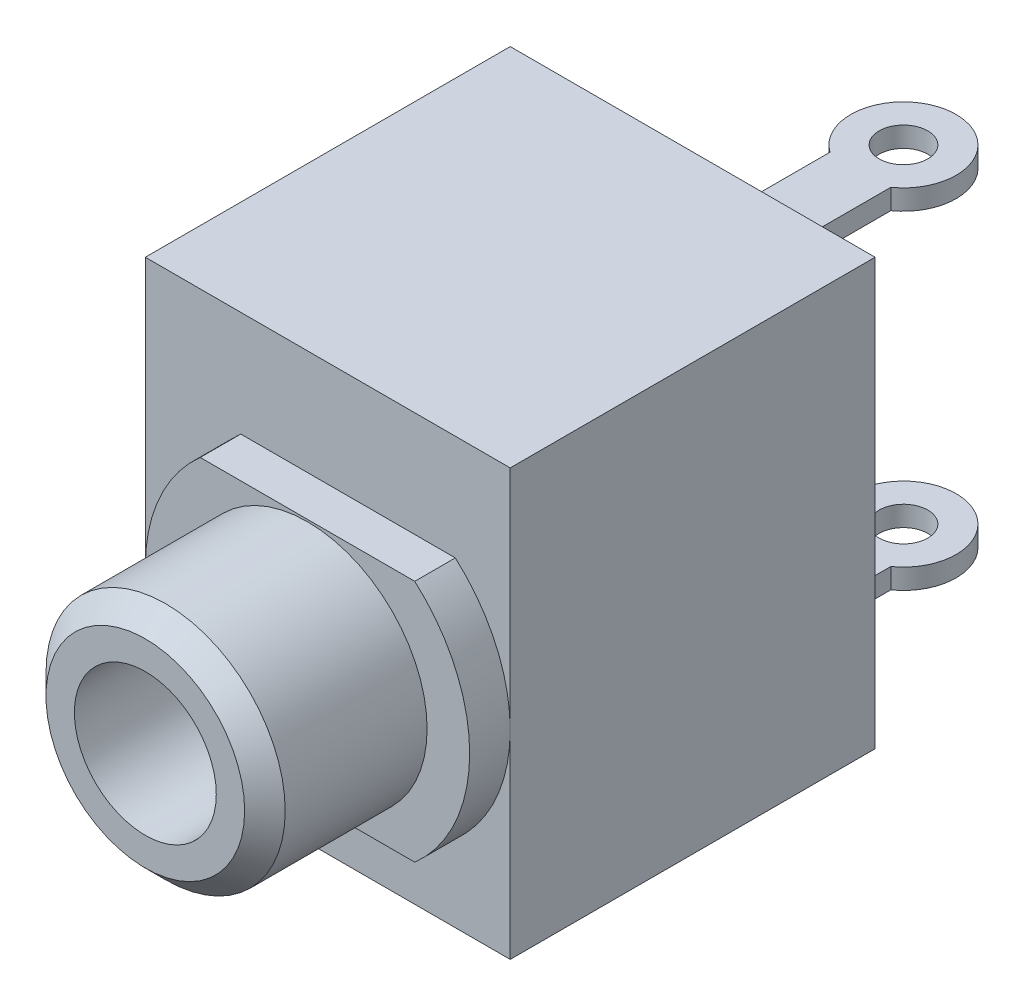
ISO-10303-21;
HEADER;
FILE_DESCRIPTION(('STEP AP214'),'2;1');
FILE_NAME('part.step','',(''),(''),'','','');
FILE_SCHEMA(('AUTOMOTIVE_DESIGN { 1 0 10303 214 1 1 1 1 }'));
ENDSEC;
DATA;
#1=APPLICATION_CONTEXT('core data for automotive mechanical design processes');
#2=APPLICATION_PROTOCOL_DEFINITION('international standard','automotive_design',2000,#1);
#3=PRODUCT_CONTEXT('',#1,'mechanical');
#4=PRODUCT('Part','Part','',(#3));
#5=PRODUCT_RELATED_PRODUCT_CATEGORY('part','',(#4));
#6=PRODUCT_DEFINITION_FORMATION('','',#4);
#7=PRODUCT_DEFINITION_CONTEXT('part definition',#1,'design');
#8=PRODUCT_DEFINITION('design','',#6,#7);
#9=PRODUCT_DEFINITION_SHAPE('','',#8);
#10=(LENGTH_UNIT() NAMED_UNIT(*) SI_UNIT(.MILLI.,.METRE.));
#11=(NAMED_UNIT(*) PLANE_ANGLE_UNIT() SI_UNIT($,.RADIAN.));
#12=(NAMED_UNIT(*) SI_UNIT($,.STERADIAN.) SOLID_ANGLE_UNIT());
#13=UNCERTAINTY_MEASURE_WITH_UNIT(LENGTH_MEASURE(1.E-05),#10,'distance_accuracy_value','');
#14=(GEOMETRIC_REPRESENTATION_CONTEXT(3) GLOBAL_UNCERTAINTY_ASSIGNED_CONTEXT((#13)) GLOBAL_UNIT_ASSIGNED_CONTEXT((#10,
#11,#12)) REPRESENTATION_CONTEXT('',''));
#15=CARTESIAN_POINT('',(0.,0.,0.));
#16=DIRECTION('',(0.,0.,1.));
#17=DIRECTION('',(1.,0.,0.));
#18=AXIS2_PLACEMENT_3D('',#15,#16,#17);
#19=CARTESIAN_POINT('',(0.,0.,0.));
#20=DIRECTION('',(0.,0.,1.));
#21=DIRECTION('',(1.,0.,0.));
#22=AXIS2_PLACEMENT_3D('',#19,#20,#21);
#23=PLANE('',#22);
#24=DIRECTION('',(0.,-1.,0.));
#25=VECTOR('',#24,1.);
#26=CARTESIAN_POINT('',(-3.55,0.,0.));
#27=LINE('',#26,#25);
#28=CARTESIAN_POINT('',(-3.55,-0.650000000000002,0.));
#29=VERTEX_POINT('',#28);
#30=CARTESIAN_POINT('',(-3.55,-2.15,0.));
#31=VERTEX_POINT('',#30);
#32=EDGE_CURVE('E525',#29,#31,#27,.T.);
#33=ORIENTED_EDGE('',*,*,#32,.F.);
#34=DIRECTION('',(1.,0.,0.));
#35=VECTOR('',#34,1.);
#36=CARTESIAN_POINT('',(0.,-0.650000000000002,0.));
#37=LINE('',#36,#35);
#38=CARTESIAN_POINT('',(-4.05,-0.650000000000002,0.));
#39=VERTEX_POINT('',#38);
#40=EDGE_CURVE('E533',#39,#29,#37,.T.);
#41=ORIENTED_EDGE('',*,*,#40,.F.);
#42=DIRECTION('',(0.,-1.,0.));
#43=VECTOR('',#42,1.);
#44=CARTESIAN_POINT('',(-4.05,0.,0.));
#45=LINE('',#44,#43);
#46=CARTESIAN_POINT('',(-4.05,-2.15,0.));
#47=VERTEX_POINT('',#46);
#48=EDGE_CURVE('E194',#39,#47,#45,.T.);
#49=ORIENTED_EDGE('',*,*,#48,.T.);
#50=DIRECTION('',(1.,0.,0.));
#51=VECTOR('',#50,1.);
#52=CARTESIAN_POINT('',(0.,-2.15,0.));
#53=LINE('',#52,#51);
#54=EDGE_CURVE('E198',#47,#31,#53,.T.);
#55=ORIENTED_EDGE('',*,*,#54,.T.);
#56=EDGE_LOOP('',(#33,#41,#49,#55));
#57=FACE_BOUND('',#56,.T.);
#58=DIRECTION('',(0.,-1.,0.));
#59=VECTOR('',#58,1.);
#60=CARTESIAN_POINT('',(4.,0.,0.));
#61=LINE('',#60,#59);
#62=CARTESIAN_POINT('',(4.,5.6,0.));
#63=VERTEX_POINT('',#62);
#64=CARTESIAN_POINT('',(4.,-4.9,0.));
#65=VERTEX_POINT('',#64);
#66=EDGE_CURVE('E260',#63,#65,#61,.T.);
#67=ORIENTED_EDGE('',*,*,#66,.T.);
#68=DIRECTION('',(1.,0.,0.));
#69=VECTOR('',#68,1.);
#70=CARTESIAN_POINT('',(0.,-4.9,0.));
#71=LINE('',#70,#69);
#72=CARTESIAN_POINT('',(-5.,-4.9,0.));
#73=VERTEX_POINT('',#72);
#74=EDGE_CURVE('E281',#73,#65,#71,.T.);
#75=ORIENTED_EDGE('',*,*,#74,.F.);
#76=DIRECTION('',(0.,-1.,0.));
#77=VECTOR('',#76,1.);
#78=CARTESIAN_POINT('',(-5.,0.,0.));
#79=LINE('',#78,#77);
#80=CARTESIAN_POINT('',(-5.,5.6,0.));
#81=VERTEX_POINT('',#80);
#82=EDGE_CURVE('E279',#81,#73,#79,.T.);
#83=ORIENTED_EDGE('',*,*,#82,.F.);
#84=DIRECTION('',(1.,0.,0.));
#85=VECTOR('',#84,1.);
#86=CARTESIAN_POINT('',(0.,5.6,0.));
#87=LINE('',#86,#85);
#88=EDGE_CURVE('E276',#81,#63,#87,.T.);
#89=ORIENTED_EDGE('',*,*,#88,.T.);
#90=EDGE_LOOP('',(#67,#75,#83,#89));
#91=FACE_BOUND('',#90,.T.);
#92=DIRECTION('',(0.,-1.,0.));
#93=VECTOR('',#92,1.);
#94=CARTESIAN_POINT('',(1.75,0.,0.));
#95=LINE('',#94,#93);
#96=CARTESIAN_POINT('',(1.75,-3.45,0.));
#97=VERTEX_POINT('',#96);
#98=CARTESIAN_POINT('',(1.75,-3.95,0.));
#99=VERTEX_POINT('',#98);
#100=EDGE_CURVE('E202',#97,#99,#95,.T.);
#101=ORIENTED_EDGE('',*,*,#100,.F.);
#102=DIRECTION('',(1.,0.,0.));
#103=VECTOR('',#102,1.);
#104=CARTESIAN_POINT('',(0.,-3.45,0.));
#105=LINE('',#104,#103);
#106=CARTESIAN_POINT('',(0.25,-3.45,0.));
#107=VERTEX_POINT('',#106);
#108=EDGE_CURVE('E205',#107,#97,#105,.T.);
#109=ORIENTED_EDGE('',*,*,#108,.F.);
#110=DIRECTION('',(0.,-1.,0.));
#111=VECTOR('',#110,1.);
#112=CARTESIAN_POINT('',(0.25,0.,0.));
#113=LINE('',#112,#111);
#114=CARTESIAN_POINT('',(0.25,-3.95,0.));
#115=VERTEX_POINT('',#114);
#116=EDGE_CURVE('E208',#107,#115,#113,.T.);
#117=ORIENTED_EDGE('',*,*,#116,.T.);
#118=DIRECTION('',(1.,0.,0.));
#119=VECTOR('',#118,1.);
#120=CARTESIAN_POINT('',(0.,-3.95,0.));
#121=LINE('',#120,#119);
#122=EDGE_CURVE('E211',#115,#99,#121,.T.);
#123=ORIENTED_EDGE('',*,*,#122,.T.);
#124=EDGE_LOOP('',(#101,#109,#117,#123));
#125=FACE_BOUND('',#124,.T.);
#126=DIRECTION('',(0.,-1.,0.));
#127=VECTOR('',#126,1.);
#128=CARTESIAN_POINT('',(1.75,0.,0.));
#129=LINE('',#128,#127);
#130=CARTESIAN_POINT('',(1.75,4.65,0.));
#131=VERTEX_POINT('',#130);
#132=CARTESIAN_POINT('',(1.75,4.15,0.));
#133=VERTEX_POINT('',#132);
#134=EDGE_CURVE('E510',#131,#133,#129,.T.);
#135=ORIENTED_EDGE('',*,*,#134,.F.);
#136=DIRECTION('',(1.,0.,0.));
#137=VECTOR('',#136,1.);
#138=CARTESIAN_POINT('',(0.,4.65,0.));
#139=LINE('',#138,#137);
#140=CARTESIAN_POINT('',(0.25,4.65,0.));
#141=VERTEX_POINT('',#140);
#142=EDGE_CURVE('E513',#141,#131,#139,.T.);
#143=ORIENTED_EDGE('',*,*,#142,.F.);
#144=DIRECTION('',(0.,-1.,0.));
#145=VECTOR('',#144,1.);
#146=CARTESIAN_POINT('',(0.250000000000001,0.,0.));
#147=LINE('',#146,#145);
#148=CARTESIAN_POINT('',(0.25,4.15,0.));
#149=VERTEX_POINT('',#148);
#150=EDGE_CURVE('E516',#141,#149,#147,.T.);
#151=ORIENTED_EDGE('',*,*,#150,.T.);
#152=DIRECTION('',(1.,0.,0.));
#153=VECTOR('',#152,1.);
#154=CARTESIAN_POINT('',(0.,4.15,0.));
#155=LINE('',#154,#153);
#156=EDGE_CURVE('E519',#149,#133,#155,.T.);
#157=ORIENTED_EDGE('',*,*,#156,.T.);
#158=EDGE_LOOP('',(#135,#143,#151,#157));
#159=FACE_BOUND('',#158,.T.);
#160=ADVANCED_FACE('F35',(#57,#91,#125,#159),#23,.F.);
#161=CARTESIAN_POINT('',(4.,0.,9.));
#162=DIRECTION('',(1.,0.,0.));
#163=DIRECTION('',(0.,1.,0.));
#164=AXIS2_PLACEMENT_3D('',#161,#162,#163);
#165=PLANE('',#164);
#166=ORIENTED_EDGE('',*,*,#66,.F.);
#167=DIRECTION('',(0.,0.,-1.));
#168=VECTOR('',#167,1.);
#169=CARTESIAN_POINT('',(4.,5.6,9.));
#170=LINE('',#169,#168);
#171=CARTESIAN_POINT('',(4.,5.6,9.));
#172=VERTEX_POINT('',#171);
#173=EDGE_CURVE('E290',#172,#63,#170,.T.);
#174=ORIENTED_EDGE('',*,*,#173,.F.);
#175=DIRECTION('',(0.,-1.,0.));
#176=VECTOR('',#175,1.);
#177=CARTESIAN_POINT('',(4.,0.,9.));
#178=LINE('',#177,#176);
#179=CARTESIAN_POINT('',(4.,0.,9.));
#180=VERTEX_POINT('',#179);
#181=EDGE_CURVE('E261',#172,#180,#178,.T.);
#182=ORIENTED_EDGE('',*,*,#181,.T.);
#183=CARTESIAN_POINT('',(4.,-4.9,9.));
#184=VERTEX_POINT('',#183);
#185=EDGE_CURVE('E265',#180,#184,#178,.T.);
#186=ORIENTED_EDGE('',*,*,#185,.T.);
#187=DIRECTION('',(0.,0.,-1.));
#188=VECTOR('',#187,1.);
#189=CARTESIAN_POINT('',(4.,-4.9,9.));
#190=LINE('',#189,#188);
#191=EDGE_CURVE('E273',#184,#65,#190,.T.);
#192=ORIENTED_EDGE('',*,*,#191,.T.);
#193=EDGE_LOOP('',(#166,#174,#182,#186,#192));
#194=FACE_BOUND('',#193,.T.);
#195=ADVANCED_FACE('F308',(#194),#165,.T.);
#196=CARTESIAN_POINT('',(0.,5.6,9.));
#197=DIRECTION('',(0.,1.,0.));
#198=DIRECTION('',(0.,0.,1.));
#199=AXIS2_PLACEMENT_3D('',#196,#197,#198);
#200=PLANE('',#199);
#201=ORIENTED_EDGE('',*,*,#88,.F.);
#202=DIRECTION('',(0.,0.,-1.));
#203=VECTOR('',#202,1.);
#204=CARTESIAN_POINT('',(-5.,5.6,9.));
#205=LINE('',#204,#203);
#206=CARTESIAN_POINT('',(-5.,5.6,9.));
#207=VERTEX_POINT('',#206);
#208=EDGE_CURVE('E288',#207,#81,#205,.T.);
#209=ORIENTED_EDGE('',*,*,#208,.F.);
#210=DIRECTION('',(1.,0.,0.));
#211=VECTOR('',#210,1.);
#212=CARTESIAN_POINT('',(0.,5.6,9.));
#213=LINE('',#212,#211);
#214=EDGE_CURVE('E264',#207,#172,#213,.T.);
#215=ORIENTED_EDGE('',*,*,#214,.T.);
#216=ORIENTED_EDGE('',*,*,#173,.T.);
#217=EDGE_LOOP('',(#201,#209,#215,#216));
#218=FACE_BOUND('',#217,.T.);
#219=ADVANCED_FACE('F314',(#218),#200,.T.);
#220=CARTESIAN_POINT('',(-5.,0.,9.));
#221=DIRECTION('',(1.,0.,0.));
#222=DIRECTION('',(0.,0.,-1.));
#223=AXIS2_PLACEMENT_3D('',#220,#221,#222);
#224=PLANE('',#223);
#225=ORIENTED_EDGE('',*,*,#82,.T.);
#226=DIRECTION('',(0.,0.,-1.));
#227=VECTOR('',#226,1.);
#228=CARTESIAN_POINT('',(-5.,-4.9,9.));
#229=LINE('',#228,#227);
#230=CARTESIAN_POINT('',(-5.,-4.9,9.));
#231=VERTEX_POINT('',#230);
#232=EDGE_CURVE('E285',#231,#73,#229,.T.);
#233=ORIENTED_EDGE('',*,*,#232,.F.);
#234=DIRECTION('',(0.,-1.,0.));
#235=VECTOR('',#234,1.);
#236=CARTESIAN_POINT('',(-5.,0.,9.));
#237=LINE('',#236,#235);
#238=EDGE_CURVE('E268',#207,#231,#237,.T.);
#239=ORIENTED_EDGE('',*,*,#238,.F.);
#240=ORIENTED_EDGE('',*,*,#208,.T.);
#241=EDGE_LOOP('',(#225,#233,#239,#240));
#242=FACE_BOUND('',#241,.T.);
#243=ADVANCED_FACE('F325',(#242),#224,.F.);
#244=CARTESIAN_POINT('',(0.,-4.9,9.));
#245=DIRECTION('',(0.,1.,0.));
#246=DIRECTION('',(0.,0.,1.));
#247=AXIS2_PLACEMENT_3D('',#244,#245,#246);
#248=PLANE('',#247);
#249=ORIENTED_EDGE('',*,*,#74,.T.);
#250=ORIENTED_EDGE('',*,*,#191,.F.);
#251=DIRECTION('',(1.,0.,0.));
#252=VECTOR('',#251,1.);
#253=CARTESIAN_POINT('',(0.,-4.9,9.));
#254=LINE('',#253,#252);
#255=EDGE_CURVE('E270',#231,#184,#254,.T.);
#256=ORIENTED_EDGE('',*,*,#255,.F.);
#257=ORIENTED_EDGE('',*,*,#232,.T.);
#258=EDGE_LOOP('',(#249,#250,#256,#257));
#259=FACE_BOUND('',#258,.T.);
#260=ADVANCED_FACE('F322',(#259),#248,.F.);
#261=CARTESIAN_POINT('',(0.,0.,9.));
#262=DIRECTION('',(0.,0.,1.));
#263=DIRECTION('',(1.,0.,0.));
#264=AXIS2_PLACEMENT_3D('',#261,#262,#263);
#265=PLANE('',#264);
#266=CARTESIAN_POINT('',(0.,0.,9.));
#267=DIRECTION('',(0.,0.,1.));
#268=DIRECTION('',(1.,0.,0.));
#269=AXIS2_PLACEMENT_3D('',#266,#267,#268);
#270=CIRCLE('',#269,4.);
#271=CARTESIAN_POINT('',(2.64575131106459,3.,9.));
#272=VERTEX_POINT('',#271);
#273=EDGE_CURVE('E245',#180,#272,#270,.T.);
#274=ORIENTED_EDGE('',*,*,#273,.F.);
#275=ORIENTED_EDGE('',*,*,#181,.F.);
#276=ORIENTED_EDGE('',*,*,#214,.F.);
#277=ORIENTED_EDGE('',*,*,#238,.T.);
#278=ORIENTED_EDGE('',*,*,#255,.T.);
#279=ORIENTED_EDGE('',*,*,#185,.F.);
#280=CARTESIAN_POINT('',(2.64575131106459,-3.,9.));
#281=VERTEX_POINT('',#280);
#282=EDGE_CURVE('E230',#281,#180,#270,.T.);
#283=ORIENTED_EDGE('',*,*,#282,.F.);
#284=DIRECTION('',(1.,0.,0.));
#285=VECTOR('',#284,1.);
#286=CARTESIAN_POINT('',(0.,-3.,9.));
#287=LINE('',#286,#285);
#288=CARTESIAN_POINT('',(-2.64575131106459,-3.,9.));
#289=VERTEX_POINT('',#288);
#290=EDGE_CURVE('E244',#289,#281,#287,.T.);
#291=ORIENTED_EDGE('',*,*,#290,.F.);
#292=CARTESIAN_POINT('',(-2.64575131106459,3.,9.));
#293=VERTEX_POINT('',#292);
#294=EDGE_CURVE('E241',#293,#289,#270,.T.);
#295=ORIENTED_EDGE('',*,*,#294,.F.);
#296=DIRECTION('',(1.,0.,0.));
#297=VECTOR('',#296,1.);
#298=CARTESIAN_POINT('',(0.,3.,9.));
#299=LINE('',#298,#297);
#300=EDGE_CURVE('E225',#293,#272,#299,.T.);
#301=ORIENTED_EDGE('',*,*,#300,.T.);
#302=EDGE_LOOP('',(#274,#275,#276,#277,#278,#279,#283,#291,#295,#301));
#303=FACE_BOUND('',#302,.T.);
#304=ADVANCED_FACE('F320',(#303),#265,.T.);
#305=CARTESIAN_POINT('',(0.,3.,10.));
#306=DIRECTION('',(0.,1.,0.));
#307=DIRECTION('',(0.,0.,1.));
#308=AXIS2_PLACEMENT_3D('',#305,#306,#307);
#309=PLANE('',#308);
#310=ORIENTED_EDGE('',*,*,#300,.F.);
#311=DIRECTION('',(0.,0.,-1.));
#312=VECTOR('',#311,1.);
#313=CARTESIAN_POINT('',(-2.64575131106459,3.,10.));
#314=LINE('',#313,#312);
#315=CARTESIAN_POINT('',(-2.64575131106459,3.,10.));
#316=VERTEX_POINT('',#315);
#317=EDGE_CURVE('E257',#316,#293,#314,.T.);
#318=ORIENTED_EDGE('',*,*,#317,.F.);
#319=DIRECTION('',(1.,0.,0.));
#320=VECTOR('',#319,1.);
#321=CARTESIAN_POINT('',(0.,3.,10.));
#322=LINE('',#321,#320);
#323=CARTESIAN_POINT('',(2.64575131106459,3.,10.));
#324=VERTEX_POINT('',#323);
#325=EDGE_CURVE('E229',#316,#324,#322,.T.);
#326=ORIENTED_EDGE('',*,*,#325,.T.);
#327=DIRECTION('',(0.,0.,-1.));
#328=VECTOR('',#327,1.);
#329=CARTESIAN_POINT('',(2.64575131106459,3.,10.));
#330=LINE('',#329,#328);
#331=EDGE_CURVE('E248',#324,#272,#330,.T.);
#332=ORIENTED_EDGE('',*,*,#331,.T.);
#333=EDGE_LOOP('',(#310,#318,#326,#332));
#334=FACE_BOUND('',#333,.T.);
#335=ADVANCED_FACE('F362',(#334),#309,.T.);
#336=CARTESIAN_POINT('',(0.,0.,10.));
#337=DIRECTION('',(0.,0.,-1.));
#338=DIRECTION('',(-1.,0.,0.));
#339=AXIS2_PLACEMENT_3D('',#336,#337,#338);
#340=CYLINDRICAL_SURFACE('',#339,4.);
#341=ORIENTED_EDGE('',*,*,#294,.T.);
#342=DIRECTION('',(0.,0.,-1.));
#343=VECTOR('',#342,1.);
#344=CARTESIAN_POINT('',(-2.64575131106459,-3.,10.));
#345=LINE('',#344,#343);
#346=CARTESIAN_POINT('',(-2.64575131106459,-3.,10.));
#347=VERTEX_POINT('',#346);
#348=EDGE_CURVE('E254',#347,#289,#345,.T.);
#349=ORIENTED_EDGE('',*,*,#348,.F.);
#350=CARTESIAN_POINT('',(0.,0.,10.));
#351=DIRECTION('',(0.,0.,1.));
#352=DIRECTION('',(1.,0.,0.));
#353=AXIS2_PLACEMENT_3D('',#350,#351,#352);
#354=CIRCLE('',#353,4.);
#355=EDGE_CURVE('E233',#316,#347,#354,.T.);
#356=ORIENTED_EDGE('',*,*,#355,.F.);
#357=ORIENTED_EDGE('',*,*,#317,.T.);
#358=EDGE_LOOP('',(#341,#349,#356,#357));
#359=FACE_BOUND('',#358,.T.);
#360=ADVANCED_FACE('F358',(#359),#340,.T.);
#361=CARTESIAN_POINT('',(0.,-3.,10.));
#362=DIRECTION('',(0.,1.,0.));
#363=DIRECTION('',(0.,0.,1.));
#364=AXIS2_PLACEMENT_3D('',#361,#362,#363);
#365=PLANE('',#364);
#366=ORIENTED_EDGE('',*,*,#290,.T.);
#367=DIRECTION('',(0.,0.,-1.));
#368=VECTOR('',#367,1.);
#369=CARTESIAN_POINT('',(2.64575131106459,-3.,10.));
#370=LINE('',#369,#368);
#371=CARTESIAN_POINT('',(2.64575131106459,-3.,10.));
#372=VERTEX_POINT('',#371);
#373=EDGE_CURVE('E251',#372,#281,#370,.T.);
#374=ORIENTED_EDGE('',*,*,#373,.F.);
#375=DIRECTION('',(1.,0.,0.));
#376=VECTOR('',#375,1.);
#377=CARTESIAN_POINT('',(0.,-3.,10.));
#378=LINE('',#377,#376);
#379=EDGE_CURVE('E236',#347,#372,#378,.T.);
#380=ORIENTED_EDGE('',*,*,#379,.F.);
#381=ORIENTED_EDGE('',*,*,#348,.T.);
#382=EDGE_LOOP('',(#366,#374,#380,#381));
#383=FACE_BOUND('',#382,.T.);
#384=ADVANCED_FACE('F355',(#383),#365,.F.);
#385=ORIENTED_EDGE('',*,*,#282,.T.);
#386=ORIENTED_EDGE('',*,*,#273,.T.);
#387=ORIENTED_EDGE('',*,*,#331,.F.);
#388=EDGE_CURVE('E237',#372,#324,#354,.T.);
#389=ORIENTED_EDGE('',*,*,#388,.F.);
#390=ORIENTED_EDGE('',*,*,#373,.T.);
#391=EDGE_LOOP('',(#385,#386,#387,#389,#390));
#392=FACE_BOUND('',#391,.T.);
#393=ADVANCED_FACE('F350',(#392),#340,.T.);
#394=CARTESIAN_POINT('',(0.,0.,10.));
#395=DIRECTION('',(0.,0.,1.));
#396=DIRECTION('',(1.,0.,0.));
#397=AXIS2_PLACEMENT_3D('',#394,#395,#396);
#398=PLANE('',#397);
#399=CARTESIAN_POINT('',(0.,0.,10.));
#400=DIRECTION('',(0.,0.,1.));
#401=DIRECTION('',(1.,0.,0.));
#402=AXIS2_PLACEMENT_3D('',#399,#400,#401);
#403=CIRCLE('',#402,2.95);
#404=CARTESIAN_POINT('',(2.95,0.,10.));
#405=VERTEX_POINT('',#404);
#406=EDGE_CURVE('E226',#405,#405,#403,.T.);
#407=ORIENTED_EDGE('',*,*,#406,.F.);
#408=EDGE_LOOP('',(#407));
#409=FACE_BOUND('',#408,.T.);
#410=ORIENTED_EDGE('',*,*,#325,.F.);
#411=ORIENTED_EDGE('',*,*,#355,.T.);
#412=ORIENTED_EDGE('',*,*,#379,.T.);
#413=ORIENTED_EDGE('',*,*,#388,.T.);
#414=EDGE_LOOP('',(#410,#411,#412,#413));
#415=FACE_BOUND('',#414,.T.);
#416=ADVANCED_FACE('F364',(#409,#415),#398,.T.);
#417=CARTESIAN_POINT('',(0.,0.,14.));
#418=DIRECTION('',(0.,0.,-1.));
#419=DIRECTION('',(-1.,0.,0.));
#420=AXIS2_PLACEMENT_3D('',#417,#418,#419);
#421=CYLINDRICAL_SURFACE('',#420,1.75);
#422=CARTESIAN_POINT('',(0.,0.,14.));
#423=DIRECTION('',(0.,0.,1.));
#424=DIRECTION('',(1.,0.,0.));
#425=AXIS2_PLACEMENT_3D('',#422,#423,#424);
#426=CIRCLE('',#425,1.75);
#427=CARTESIAN_POINT('',(1.75,0.,14.));
#428=VERTEX_POINT('',#427);
#429=EDGE_CURVE('E217',#428,#428,#426,.T.);
#430=ORIENTED_EDGE('',*,*,#429,.T.);
#431=EDGE_LOOP('',(#430));
#432=FACE_BOUND('',#431,.T.);
#433=CARTESIAN_POINT('',(0.,0.,9.));
#434=DIRECTION('',(0.,0.,1.));
#435=DIRECTION('',(1.,0.,0.));
#436=AXIS2_PLACEMENT_3D('',#433,#434,#435);
#437=CIRCLE('',#436,1.75);
#438=CARTESIAN_POINT('',(1.75,0.,9.));
#439=VERTEX_POINT('',#438);
#440=EDGE_CURVE('E189',#439,#439,#437,.F.);
#441=ORIENTED_EDGE('',*,*,#440,.T.);
#442=EDGE_LOOP('',(#441));
#443=FACE_BOUND('',#442,.T.);
#444=ADVANCED_FACE('F366',(#432,#443),#421,.F.);
#445=CARTESIAN_POINT('',(0.,0.,14.));
#446=DIRECTION('',(0.,0.,-1.));
#447=DIRECTION('',(-1.,0.,0.));
#448=AXIS2_PLACEMENT_3D('',#445,#446,#447);
#449=CYLINDRICAL_SURFACE('',#448,2.95);
#450=CARTESIAN_POINT('',(0.,0.,13.5));
#451=DIRECTION('',(0.,0.,1.));
#452=DIRECTION('',(1.,0.,0.));
#453=AXIS2_PLACEMENT_3D('',#450,#451,#452);
#454=CIRCLE('',#453,2.95);
#455=CARTESIAN_POINT('',(2.95,0.,13.5));
#456=VERTEX_POINT('',#455);
#457=EDGE_CURVE('E11',#456,#456,#454,.F.);
#458=ORIENTED_EDGE('',*,*,#457,.T.);
#459=EDGE_LOOP('',(#458));
#460=FACE_BOUND('',#459,.T.);
#461=ORIENTED_EDGE('',*,*,#406,.T.);
#462=EDGE_LOOP('',(#461));
#463=FACE_BOUND('',#462,.T.);
#464=ADVANCED_FACE('F373',(#460,#463),#449,.T.);
#465=CARTESIAN_POINT('',(0.,0.,14.));
#466=DIRECTION('',(0.,0.,1.));
#467=DIRECTION('',(1.,0.,0.));
#468=AXIS2_PLACEMENT_3D('',#465,#466,#467);
#469=PLANE('',#468);
#470=CARTESIAN_POINT('',(0.,0.,14.));
#471=DIRECTION('',(0.,0.,1.));
#472=DIRECTION('',(1.,0.,0.));
#473=AXIS2_PLACEMENT_3D('',#470,#471,#472);
#474=CIRCLE('',#473,2.45);
#475=CARTESIAN_POINT('',(2.45,0.,14.));
#476=VERTEX_POINT('',#475);
#477=EDGE_CURVE('E43',#476,#476,#474,.T.);
#478=ORIENTED_EDGE('',*,*,#477,.T.);
#479=EDGE_LOOP('',(#478));
#480=FACE_BOUND('',#479,.T.);
#481=ORIENTED_EDGE('',*,*,#429,.F.);
#482=EDGE_LOOP('',(#481));
#483=FACE_BOUND('',#482,.T.);
#484=ADVANCED_FACE('F296',(#480,#483),#469,.T.);
#485=ORIENTED_EDGE('',*,*,#440,.F.);
#486=EDGE_LOOP('',(#485));
#487=FACE_BOUND('',#486,.T.);
#488=ADVANCED_FACE('F386',(#487),#265,.T.);
#489=CARTESIAN_POINT('',(1.75,0.,-3.7));
#490=DIRECTION('',(-1.,0.,0.));
#491=DIRECTION('',(0.,0.,1.));
#492=AXIS2_PLACEMENT_3D('',#489,#490,#491);
#493=PLANE('',#492);
#494=DIRECTION('',(0.,0.,1.));
#495=VECTOR('',#494,1.);
#496=CARTESIAN_POINT('',(1.75,-3.95,-3.7));
#497=LINE('',#496,#495);
#498=CARTESIAN_POINT('',(1.75,-3.95,-2.63816197092024));
#499=VERTEX_POINT('',#498);
#500=EDGE_CURVE('E215',#499,#99,#497,.T.);
#501=ORIENTED_EDGE('',*,*,#500,.F.);
#502=DIRECTION('',(0.,-1.,0.));
#503=VECTOR('',#502,1.);
#504=CARTESIAN_POINT('',(1.75,0.226955262170047,-2.63816197092024));
#505=LINE('',#504,#503);
#506=CARTESIAN_POINT('',(1.75,-3.45,-2.63816197092024));
#507=VERTEX_POINT('',#506);
#508=EDGE_CURVE('E508',#499,#507,#505,.F.);
#509=ORIENTED_EDGE('',*,*,#508,.T.);
#510=DIRECTION('',(0.,0.,1.));
#511=VECTOR('',#510,1.);
#512=CARTESIAN_POINT('',(1.75,-3.45,-3.7));
#513=LINE('',#512,#511);
#514=EDGE_CURVE('E214',#507,#97,#513,.T.);
#515=ORIENTED_EDGE('',*,*,#514,.T.);
#516=ORIENTED_EDGE('',*,*,#100,.T.);
#517=EDGE_LOOP('',(#501,#509,#515,#516));
#518=FACE_BOUND('',#517,.T.);
#519=ADVANCED_FACE('F390',(#518),#493,.F.);
#520=CARTESIAN_POINT('',(0.,-3.95,-3.7));
#521=DIRECTION('',(0.,-1.,0.));
#522=DIRECTION('',(0.,0.,-1.));
#523=AXIS2_PLACEMENT_3D('',#520,#521,#522);
#524=PLANE('',#523);
#525=CARTESIAN_POINT('',(1.,-3.95,-3.7));
#526=DIRECTION('',(0.,-1.,0.));
#527=DIRECTION('',(0.,0.,-1.));
#528=AXIS2_PLACEMENT_3D('',#525,#526,#527);
#529=CIRCLE('',#528,0.6);
#530=CARTESIAN_POINT('',(1.,-3.95,-4.3));
#531=VERTEX_POINT('',#530);
#532=EDGE_CURVE('E493',#531,#531,#529,.T.);
#533=ORIENTED_EDGE('',*,*,#532,.F.);
#534=EDGE_LOOP('',(#533));
#535=FACE_BOUND('',#534,.T.);
#536=CARTESIAN_POINT('',(1.,-3.95,-3.7));
#537=DIRECTION('',(0.,-1.,0.));
#538=DIRECTION('',(0.,0.,-1.));
#539=AXIS2_PLACEMENT_3D('',#536,#537,#538);
#540=CIRCLE('',#539,1.3);
#541=CARTESIAN_POINT('',(0.25,-3.95,-2.63816197092024));
#542=VERTEX_POINT('',#541);
#543=EDGE_CURVE('E498',#542,#499,#540,.T.);
#544=ORIENTED_EDGE('',*,*,#543,.T.);
#545=ORIENTED_EDGE('',*,*,#500,.T.);
#546=ORIENTED_EDGE('',*,*,#122,.F.);
#547=DIRECTION('',(0.,0.,1.));
#548=VECTOR('',#547,1.);
#549=CARTESIAN_POINT('',(0.25,-3.95,-3.7));
#550=LINE('',#549,#548);
#551=EDGE_CURVE('E218',#542,#115,#550,.T.);
#552=ORIENTED_EDGE('',*,*,#551,.F.);
#553=EDGE_LOOP('',(#544,#545,#546,#552));
#554=FACE_BOUND('',#553,.T.);
#555=ADVANCED_FACE('F396',(#535,#554),#524,.T.);
#556=CARTESIAN_POINT('',(0.25,0.,-3.7));
#557=DIRECTION('',(-1.,0.,0.));
#558=DIRECTION('',(0.,-1.,0.));
#559=AXIS2_PLACEMENT_3D('',#556,#557,#558);
#560=PLANE('',#559);
#561=DIRECTION('',(0.,-1.,0.));
#562=VECTOR('',#561,1.);
#563=CARTESIAN_POINT('',(0.25,0.226955262170047,-2.63816197092024));
#564=LINE('',#563,#562);
#565=CARTESIAN_POINT('',(0.25,-3.45,-2.63816197092024));
#566=VERTEX_POINT('',#565);
#567=EDGE_CURVE('E505',#542,#566,#564,.F.);
#568=ORIENTED_EDGE('',*,*,#567,.F.);
#569=ORIENTED_EDGE('',*,*,#551,.T.);
#570=ORIENTED_EDGE('',*,*,#116,.F.);
#571=DIRECTION('',(0.,0.,1.));
#572=VECTOR('',#571,1.);
#573=CARTESIAN_POINT('',(0.25,-3.45,-3.7));
#574=LINE('',#573,#572);
#575=EDGE_CURVE('E220',#566,#107,#574,.T.);
#576=ORIENTED_EDGE('',*,*,#575,.F.);
#577=EDGE_LOOP('',(#568,#569,#570,#576));
#578=FACE_BOUND('',#577,.T.);
#579=ADVANCED_FACE('F411',(#578),#560,.T.);
#580=CARTESIAN_POINT('',(0.,-3.45,-3.7));
#581=DIRECTION('',(0.,-1.,0.));
#582=DIRECTION('',(0.,0.,-1.));
#583=AXIS2_PLACEMENT_3D('',#580,#581,#582);
#584=PLANE('',#583);
#585=ORIENTED_EDGE('',*,*,#514,.F.);
#586=CARTESIAN_POINT('',(1.,-3.45,-3.7));
#587=DIRECTION('',(0.,-1.,0.));
#588=DIRECTION('',(0.,0.,-1.));
#589=AXIS2_PLACEMENT_3D('',#586,#587,#588);
#590=CIRCLE('',#589,1.3);
#591=EDGE_CURVE('E494',#507,#566,#590,.F.);
#592=ORIENTED_EDGE('',*,*,#591,.T.);
#593=ORIENTED_EDGE('',*,*,#575,.T.);
#594=ORIENTED_EDGE('',*,*,#108,.T.);
#595=EDGE_LOOP('',(#585,#592,#593,#594));
#596=FACE_BOUND('',#595,.T.);
#597=CARTESIAN_POINT('',(1.,-3.45,-3.7));
#598=DIRECTION('',(0.,-1.,0.));
#599=DIRECTION('',(0.,0.,-1.));
#600=AXIS2_PLACEMENT_3D('',#597,#598,#599);
#601=CIRCLE('',#600,0.6);
#602=CARTESIAN_POINT('',(1.,-3.45,-4.3));
#603=VERTEX_POINT('',#602);
#604=EDGE_CURVE('E497',#603,#603,#601,.F.);
#605=ORIENTED_EDGE('',*,*,#604,.F.);
#606=EDGE_LOOP('',(#605));
#607=FACE_BOUND('',#606,.T.);
#608=ADVANCED_FACE('F407',(#596,#607),#584,.F.);
#609=CARTESIAN_POINT('',(-3.55,0.,-3.7));
#610=DIRECTION('',(-1.,0.,0.));
#611=DIRECTION('',(0.,-1.,0.));
#612=AXIS2_PLACEMENT_3D('',#609,#610,#611);
#613=PLANE('',#612);
#614=CARTESIAN_POINT('',(-3.55,-1.4,-3.7));
#615=DIRECTION('',(-1.,0.,0.));
#616=DIRECTION('',(0.,-1.,0.));
#617=AXIS2_PLACEMENT_3D('',#614,#615,#616);
#618=CIRCLE('',#617,0.6);
#619=CARTESIAN_POINT('',(-3.55,-2.,-3.7));
#620=VERTEX_POINT('',#619);
#621=EDGE_CURVE('E472',#620,#620,#618,.T.);
#622=ORIENTED_EDGE('',*,*,#621,.T.);
#623=EDGE_LOOP('',(#622));
#624=FACE_BOUND('',#623,.T.);
#625=DIRECTION('',(0.,0.,1.));
#626=VECTOR('',#625,1.);
#627=CARTESIAN_POINT('',(-3.55,-2.15,-3.7));
#628=LINE('',#627,#626);
#629=CARTESIAN_POINT('',(-3.55,-2.15,-2.63816197092023));
#630=VERTEX_POINT('',#629);
#631=EDGE_CURVE('E196',#630,#31,#628,.T.);
#632=ORIENTED_EDGE('',*,*,#631,.F.);
#633=CARTESIAN_POINT('',(-3.55,-1.4,-3.7));
#634=DIRECTION('',(-1.,0.,0.));
#635=DIRECTION('',(0.,-1.,0.));
#636=AXIS2_PLACEMENT_3D('',#633,#634,#635);
#637=CIRCLE('',#636,1.3);
#638=CARTESIAN_POINT('',(-3.55,-0.650000000000002,-2.63816197092023));
#639=VERTEX_POINT('',#638);
#640=EDGE_CURVE('E181',#630,#639,#637,.F.);
#641=ORIENTED_EDGE('',*,*,#640,.T.);
#642=DIRECTION('',(0.,0.,1.));
#643=VECTOR('',#642,1.);
#644=CARTESIAN_POINT('',(-3.55,-0.650000000000002,-3.7));
#645=LINE('',#644,#643);
#646=EDGE_CURVE('E188',#639,#29,#645,.T.);
#647=ORIENTED_EDGE('',*,*,#646,.T.);
#648=ORIENTED_EDGE('',*,*,#32,.T.);
#649=EDGE_LOOP('',(#632,#641,#647,#648));
#650=FACE_BOUND('',#649,.T.);
#651=ADVANCED_FACE('F410',(#624,#650),#613,.F.);
#652=CARTESIAN_POINT('',(0.,-2.15,-3.7));
#653=DIRECTION('',(0.,-1.,0.));
#654=DIRECTION('',(0.,0.,-1.));
#655=AXIS2_PLACEMENT_3D('',#652,#653,#654);
#656=PLANE('',#655);
#657=DIRECTION('',(-1.,0.,0.));
#658=VECTOR('',#657,1.);
#659=CARTESIAN_POINT('',(0.126955262170048,-2.15,-2.63816197092023));
#660=LINE('',#659,#658);
#661=CARTESIAN_POINT('',(-4.05,-2.15,-2.63816197092023));
#662=VERTEX_POINT('',#661);
#663=EDGE_CURVE('E50',#630,#662,#660,.T.);
#664=ORIENTED_EDGE('',*,*,#663,.F.);
#665=ORIENTED_EDGE('',*,*,#631,.T.);
#666=ORIENTED_EDGE('',*,*,#54,.F.);
#667=DIRECTION('',(0.,0.,1.));
#668=VECTOR('',#667,1.);
#669=CARTESIAN_POINT('',(-4.05,-2.15,-3.7));
#670=LINE('',#669,#668);
#671=EDGE_CURVE('E55',#662,#47,#670,.T.);
#672=ORIENTED_EDGE('',*,*,#671,.F.);
#673=EDGE_LOOP('',(#664,#665,#666,#672));
#674=FACE_BOUND('',#673,.T.);
#675=ADVANCED_FACE('F421',(#674),#656,.T.);
#676=CARTESIAN_POINT('',(-4.05,0.,-3.7));
#677=DIRECTION('',(-1.,0.,0.));
#678=DIRECTION('',(0.,0.,1.));
#679=AXIS2_PLACEMENT_3D('',#676,#677,#678);
#680=PLANE('',#679);
#681=CARTESIAN_POINT('',(-4.05,-1.4,-3.7));
#682=DIRECTION('',(-1.,0.,0.));
#683=DIRECTION('',(0.,0.,1.));
#684=AXIS2_PLACEMENT_3D('',#681,#682,#683);
#685=CIRCLE('',#684,0.6);
#686=CARTESIAN_POINT('',(-4.05,-1.4,-3.1));
#687=VERTEX_POINT('',#686);
#688=EDGE_CURVE('E469',#687,#687,#685,.T.);
#689=ORIENTED_EDGE('',*,*,#688,.F.);
#690=EDGE_LOOP('',(#689));
#691=FACE_BOUND('',#690,.T.);
#692=CARTESIAN_POINT('',(-4.05,-1.4,-3.7));
#693=DIRECTION('',(-1.,0.,0.));
#694=DIRECTION('',(0.,0.,1.));
#695=AXIS2_PLACEMENT_3D('',#692,#693,#694);
#696=CIRCLE('',#695,1.3);
#697=CARTESIAN_POINT('',(-4.05,-0.650000000000002,-2.63816197092023));
#698=VERTEX_POINT('',#697);
#699=EDGE_CURVE('E173',#698,#662,#696,.T.);
#700=ORIENTED_EDGE('',*,*,#699,.T.);
#701=ORIENTED_EDGE('',*,*,#671,.T.);
#702=ORIENTED_EDGE('',*,*,#48,.F.);
#703=DIRECTION('',(0.,0.,1.));
#704=VECTOR('',#703,1.);
#705=CARTESIAN_POINT('',(-4.05,-0.650000000000002,-3.7));
#706=LINE('',#705,#704);
#707=EDGE_CURVE('E186',#698,#39,#706,.T.);
#708=ORIENTED_EDGE('',*,*,#707,.F.);
#709=EDGE_LOOP('',(#700,#701,#702,#708));
#710=FACE_BOUND('',#709,.T.);
#711=ADVANCED_FACE('F192',(#691,#710),#680,.T.);
#712=CARTESIAN_POINT('',(0.,-0.650000000000002,-3.7));
#713=DIRECTION('',(0.,-1.,0.));
#714=DIRECTION('',(0.,0.,-1.));
#715=AXIS2_PLACEMENT_3D('',#712,#713,#714);
#716=PLANE('',#715);
#717=ORIENTED_EDGE('',*,*,#646,.F.);
#718=DIRECTION('',(-1.,0.,0.));
#719=VECTOR('',#718,1.);
#720=CARTESIAN_POINT('',(0.126955262170048,-0.650000000000002,-2.63816197092023));
#721=LINE('',#720,#719);
#722=EDGE_CURVE('E177',#639,#698,#721,.T.);
#723=ORIENTED_EDGE('',*,*,#722,.T.);
#724=ORIENTED_EDGE('',*,*,#707,.T.);
#725=ORIENTED_EDGE('',*,*,#40,.T.);
#726=EDGE_LOOP('',(#717,#723,#724,#725));
#727=FACE_BOUND('',#726,.T.);
#728=ADVANCED_FACE('F184',(#727),#716,.F.);
#729=CARTESIAN_POINT('',(1.75,0.,-3.7));
#730=DIRECTION('',(-1.,0.,0.));
#731=DIRECTION('',(0.,0.,1.));
#732=AXIS2_PLACEMENT_3D('',#729,#730,#731);
#733=PLANE('',#732);
#734=DIRECTION('',(0.,0.,1.));
#735=VECTOR('',#734,1.);
#736=CARTESIAN_POINT('',(1.75,4.15,-3.7));
#737=LINE('',#736,#735);
#738=CARTESIAN_POINT('',(1.75,4.15,-2.63816197092024));
#739=VERTEX_POINT('',#738);
#740=EDGE_CURVE('E523',#739,#133,#737,.T.);
#741=ORIENTED_EDGE('',*,*,#740,.F.);
#742=DIRECTION('',(0.,-1.,0.));
#743=VECTOR('',#742,1.);
#744=CARTESIAN_POINT('',(1.75,8.32695526217005,-2.63816197092024));
#745=LINE('',#744,#743);
#746=CARTESIAN_POINT('',(1.75,4.65,-2.63816197092024));
#747=VERTEX_POINT('',#746);
#748=EDGE_CURVE('E485',#739,#747,#745,.F.);
#749=ORIENTED_EDGE('',*,*,#748,.T.);
#750=DIRECTION('',(0.,0.,1.));
#751=VECTOR('',#750,1.);
#752=CARTESIAN_POINT('',(1.75,4.65,-3.7));
#753=LINE('',#752,#751);
#754=EDGE_CURVE('E522',#747,#131,#753,.T.);
#755=ORIENTED_EDGE('',*,*,#754,.T.);
#756=ORIENTED_EDGE('',*,*,#134,.T.);
#757=EDGE_LOOP('',(#741,#749,#755,#756));
#758=FACE_BOUND('',#757,.T.);
#759=ADVANCED_FACE('F425',(#758),#733,.F.);
#760=CARTESIAN_POINT('',(0.,4.15,-3.7));
#761=DIRECTION('',(0.,-1.,0.));
#762=DIRECTION('',(0.,0.,-1.));
#763=AXIS2_PLACEMENT_3D('',#760,#761,#762);
#764=PLANE('',#763);
#765=CARTESIAN_POINT('',(1.,4.15,-3.7));
#766=DIRECTION('',(0.,-1.,0.));
#767=DIRECTION('',(0.,0.,-1.));
#768=AXIS2_PLACEMENT_3D('',#765,#766,#767);
#769=CIRCLE('',#768,0.6);
#770=CARTESIAN_POINT('',(1.,4.15,-4.3));
#771=VERTEX_POINT('',#770);
#772=EDGE_CURVE('E487',#771,#771,#769,.T.);
#773=ORIENTED_EDGE('',*,*,#772,.F.);
#774=EDGE_LOOP('',(#773));
#775=FACE_BOUND('',#774,.T.);
#776=CARTESIAN_POINT('',(1.,4.15,-3.7));
#777=DIRECTION('',(0.,-1.,0.));
#778=DIRECTION('',(0.,0.,-1.));
#779=AXIS2_PLACEMENT_3D('',#776,#777,#778);
#780=CIRCLE('',#779,1.3);
#781=CARTESIAN_POINT('',(0.25,4.15,-2.63816197092024));
#782=VERTEX_POINT('',#781);
#783=EDGE_CURVE('E473',#782,#739,#780,.T.);
#784=ORIENTED_EDGE('',*,*,#783,.T.);
#785=ORIENTED_EDGE('',*,*,#740,.T.);
#786=ORIENTED_EDGE('',*,*,#156,.F.);
#787=DIRECTION('',(0.,0.,1.));
#788=VECTOR('',#787,1.);
#789=CARTESIAN_POINT('',(0.25,4.15,-3.7));
#790=LINE('',#789,#788);
#791=EDGE_CURVE('E526',#782,#149,#790,.T.);
#792=ORIENTED_EDGE('',*,*,#791,.F.);
#793=EDGE_LOOP('',(#784,#785,#786,#792));
#794=FACE_BOUND('',#793,.T.);
#795=ADVANCED_FACE('F433',(#775,#794),#764,.T.);
#796=CARTESIAN_POINT('',(0.250000000000001,0.,-3.7));
#797=DIRECTION('',(-1.,0.,0.));
#798=DIRECTION('',(0.,-1.,0.));
#799=AXIS2_PLACEMENT_3D('',#796,#797,#798);
#800=PLANE('',#799);
#801=DIRECTION('',(0.,-1.,0.));
#802=VECTOR('',#801,1.);
#803=CARTESIAN_POINT('',(0.25,8.32695526217005,-2.63816197092024));
#804=LINE('',#803,#802);
#805=CARTESIAN_POINT('',(0.25,4.65,-2.63816197092024));
#806=VERTEX_POINT('',#805);
#807=EDGE_CURVE('E481',#782,#806,#804,.F.);
#808=ORIENTED_EDGE('',*,*,#807,.F.);
#809=ORIENTED_EDGE('',*,*,#791,.T.);
#810=ORIENTED_EDGE('',*,*,#150,.F.);
#811=DIRECTION('',(0.,0.,1.));
#812=VECTOR('',#811,1.);
#813=CARTESIAN_POINT('',(0.25,4.65,-3.7));
#814=LINE('',#813,#812);
#815=EDGE_CURVE('E528',#806,#141,#814,.T.);
#816=ORIENTED_EDGE('',*,*,#815,.F.);
#817=EDGE_LOOP('',(#808,#809,#810,#816));
#818=FACE_BOUND('',#817,.T.);
#819=ADVANCED_FACE('F439',(#818),#800,.T.);
#820=CARTESIAN_POINT('',(0.,4.65,-3.7));
#821=DIRECTION('',(0.,-1.,0.));
#822=DIRECTION('',(0.,0.,-1.));
#823=AXIS2_PLACEMENT_3D('',#820,#821,#822);
#824=PLANE('',#823);
#825=CARTESIAN_POINT('',(1.,4.65,-3.7));
#826=DIRECTION('',(0.,-1.,0.));
#827=DIRECTION('',(0.,0.,-1.));
#828=AXIS2_PLACEMENT_3D('',#825,#826,#827);
#829=CIRCLE('',#828,0.6);
#830=CARTESIAN_POINT('',(1.,4.65,-4.3));
#831=VERTEX_POINT('',#830);
#832=EDGE_CURVE('E490',#831,#831,#829,.T.);
#833=ORIENTED_EDGE('',*,*,#832,.T.);
#834=EDGE_LOOP('',(#833));
#835=FACE_BOUND('',#834,.T.);
#836=ORIENTED_EDGE('',*,*,#754,.F.);
#837=CARTESIAN_POINT('',(1.,4.65,-3.7));
#838=DIRECTION('',(0.,-1.,0.));
#839=DIRECTION('',(0.,0.,-1.));
#840=AXIS2_PLACEMENT_3D('',#837,#838,#839);
#841=CIRCLE('',#840,1.3);
#842=EDGE_CURVE('E476',#747,#806,#841,.F.);
#843=ORIENTED_EDGE('',*,*,#842,.T.);
#844=ORIENTED_EDGE('',*,*,#815,.T.);
#845=ORIENTED_EDGE('',*,*,#142,.T.);
#846=EDGE_LOOP('',(#836,#843,#844,#845));
#847=FACE_BOUND('',#846,.T.);
#848=ADVANCED_FACE('F435',(#835,#847),#824,.F.);
#849=CARTESIAN_POINT('',(1.,0.226955262170047,-3.7));
#850=DIRECTION('',(0.,-1.,0.));
#851=DIRECTION('',(0.,0.,-1.));
#852=AXIS2_PLACEMENT_3D('',#849,#850,#851);
#853=CYLINDRICAL_SURFACE('',#852,1.3);
#854=ORIENTED_EDGE('',*,*,#508,.F.);
#855=ORIENTED_EDGE('',*,*,#543,.F.);
#856=ORIENTED_EDGE('',*,*,#567,.T.);
#857=ORIENTED_EDGE('',*,*,#591,.F.);
#858=EDGE_LOOP('',(#854,#855,#856,#857));
#859=FACE_BOUND('',#858,.T.);
#860=ADVANCED_FACE('F438',(#859),#853,.T.);
#861=CARTESIAN_POINT('',(1.,0.226955262170047,-3.7));
#862=DIRECTION('',(0.,-1.,0.));
#863=DIRECTION('',(0.,0.,-1.));
#864=AXIS2_PLACEMENT_3D('',#861,#862,#863);
#865=CYLINDRICAL_SURFACE('',#864,0.6);
#866=ORIENTED_EDGE('',*,*,#604,.T.);
#867=EDGE_LOOP('',(#866));
#868=FACE_BOUND('',#867,.T.);
#869=ORIENTED_EDGE('',*,*,#532,.T.);
#870=EDGE_LOOP('',(#869));
#871=FACE_BOUND('',#870,.T.);
#872=ADVANCED_FACE('F449',(#868,#871),#865,.F.);
#873=CARTESIAN_POINT('',(1.,7.85,-3.7));
#874=DIRECTION('',(0.,-1.,0.));
#875=DIRECTION('',(0.,0.,-1.));
#876=AXIS2_PLACEMENT_3D('',#873,#874,#875);
#877=CYLINDRICAL_SURFACE('',#876,0.6);
#878=ORIENTED_EDGE('',*,*,#772,.T.);
#879=EDGE_LOOP('',(#878));
#880=FACE_BOUND('',#879,.T.);
#881=ORIENTED_EDGE('',*,*,#832,.F.);
#882=EDGE_LOOP('',(#881));
#883=FACE_BOUND('',#882,.T.);
#884=ADVANCED_FACE('F453',(#880,#883),#877,.F.);
#885=CARTESIAN_POINT('',(1.,8.32695526217005,-3.7));
#886=DIRECTION('',(0.,-1.,0.));
#887=DIRECTION('',(0.,0.,-1.));
#888=AXIS2_PLACEMENT_3D('',#885,#886,#887);
#889=CYLINDRICAL_SURFACE('',#888,1.3);
#890=ORIENTED_EDGE('',*,*,#748,.F.);
#891=ORIENTED_EDGE('',*,*,#783,.F.);
#892=ORIENTED_EDGE('',*,*,#807,.T.);
#893=ORIENTED_EDGE('',*,*,#842,.F.);
#894=EDGE_LOOP('',(#890,#891,#892,#893));
#895=FACE_BOUND('',#894,.T.);
#896=ADVANCED_FACE('F457',(#895),#889,.T.);
#897=CARTESIAN_POINT('',(-0.35,-1.4,-3.7));
#898=DIRECTION('',(-1.,0.,0.));
#899=DIRECTION('',(0.,0.,1.));
#900=AXIS2_PLACEMENT_3D('',#897,#898,#899);
#901=CYLINDRICAL_SURFACE('',#900,0.6);
#902=ORIENTED_EDGE('',*,*,#688,.T.);
#903=EDGE_LOOP('',(#902));
#904=FACE_BOUND('',#903,.T.);
#905=ORIENTED_EDGE('',*,*,#621,.F.);
#906=EDGE_LOOP('',(#905));
#907=FACE_BOUND('',#906,.T.);
#908=ADVANCED_FACE('F304',(#904,#907),#901,.F.);
#909=CARTESIAN_POINT('',(0.126955262170048,-1.4,-3.7));
#910=DIRECTION('',(-1.,0.,0.));
#911=DIRECTION('',(0.,0.,1.));
#912=AXIS2_PLACEMENT_3D('',#909,#910,#911);
#913=CYLINDRICAL_SURFACE('',#912,1.3);
#914=ORIENTED_EDGE('',*,*,#640,.F.);
#915=ORIENTED_EDGE('',*,*,#663,.T.);
#916=ORIENTED_EDGE('',*,*,#699,.F.);
#917=ORIENTED_EDGE('',*,*,#722,.F.);
#918=EDGE_LOOP('',(#914,#915,#916,#917));
#919=FACE_BOUND('',#918,.T.);
#920=ADVANCED_FACE('F176',(#919),#913,.T.);
#921=CARTESIAN_POINT('',(0.,0.,14.));
#922=DIRECTION('',(0.,0.,-1.));
#923=DIRECTION('',(-1.,0.,0.));
#924=AXIS2_PLACEMENT_3D('',#921,#922,#923);
#925=CONICAL_SURFACE('',#924,2.45,0.785398163397448);
#926=ORIENTED_EDGE('',*,*,#457,.F.);
#927=EDGE_LOOP('',(#926));
#928=FACE_BOUND('',#927,.T.);
#929=ORIENTED_EDGE('',*,*,#477,.F.);
#930=EDGE_LOOP('',(#929));
#931=FACE_BOUND('',#930,.T.);
#932=ADVANCED_FACE('F37',(#928,#931),#925,.T.);
#933=CLOSED_SHELL('',(#160,#195,#219,#243,#260,#304,#335,#360,#384,#393,#416,#444,#464,#484,
#488,#519,#555,#579,#608,#651,#675,#711,#728,#759,#795,#819,#848,#860,#872,#884,#896,#908,#920,#932));
#934=MANIFOLD_SOLID_BREP('B2',#933);
#935=ADVANCED_BREP_SHAPE_REPRESENTATION('',(#18,#934),#14);
#936=SHAPE_DEFINITION_REPRESENTATION(#9,#935);
ENDSEC;
END-ISO-10303-21;
